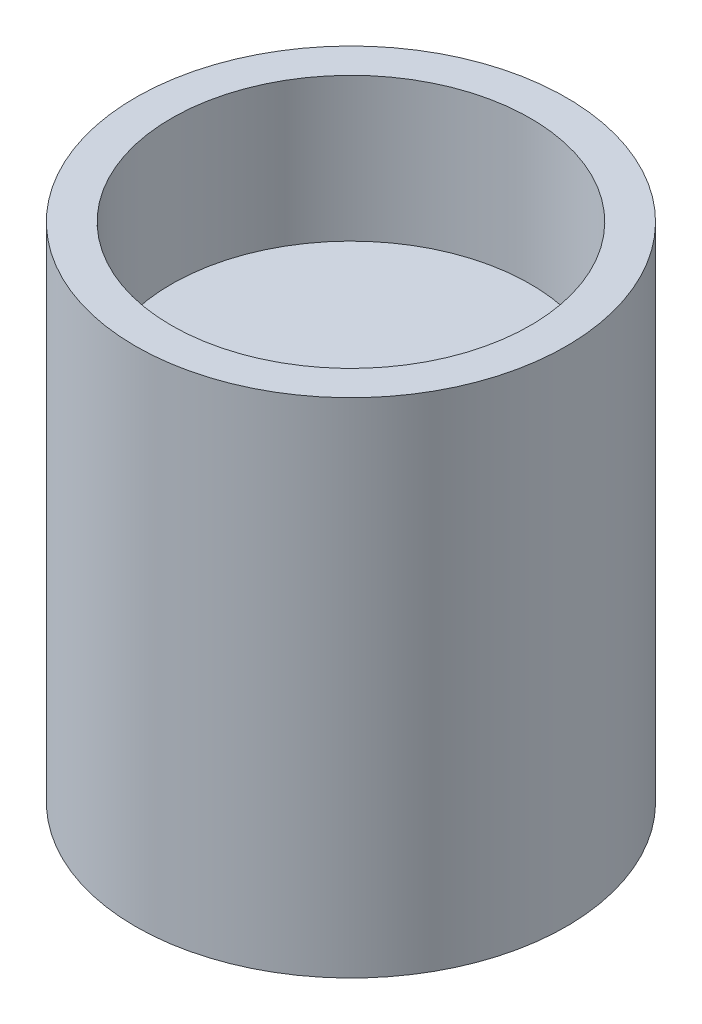
ISO-10303-21;
HEADER;
FILE_DESCRIPTION(('STEP AP214'),'2;1');
FILE_NAME('part.step','',(''),(''),'','','');
FILE_SCHEMA(('AUTOMOTIVE_DESIGN { 1 0 10303 214 1 1 1 1 }'));
ENDSEC;
DATA;
#1=APPLICATION_CONTEXT('core data for automotive mechanical design processes');
#2=APPLICATION_PROTOCOL_DEFINITION('international standard','automotive_design',2000,#1);
#3=PRODUCT_CONTEXT('',#1,'mechanical');
#4=PRODUCT('Part','Part','',(#3));
#5=PRODUCT_RELATED_PRODUCT_CATEGORY('part','',(#4));
#6=PRODUCT_DEFINITION_FORMATION('','',#4);
#7=PRODUCT_DEFINITION_CONTEXT('part definition',#1,'design');
#8=PRODUCT_DEFINITION('design','',#6,#7);
#9=PRODUCT_DEFINITION_SHAPE('','',#8);
#10=(LENGTH_UNIT() NAMED_UNIT(*) SI_UNIT(.MILLI.,.METRE.));
#11=(NAMED_UNIT(*) PLANE_ANGLE_UNIT() SI_UNIT($,.RADIAN.));
#12=(NAMED_UNIT(*) SI_UNIT($,.STERADIAN.) SOLID_ANGLE_UNIT());
#13=UNCERTAINTY_MEASURE_WITH_UNIT(LENGTH_MEASURE(1.E-05),#10,'distance_accuracy_value','');
#14=(GEOMETRIC_REPRESENTATION_CONTEXT(3) GLOBAL_UNCERTAINTY_ASSIGNED_CONTEXT((#13)) GLOBAL_UNIT_ASSIGNED_CONTEXT((#10,
#11,#12)) REPRESENTATION_CONTEXT('',''));
#15=CARTESIAN_POINT('',(0.,0.,0.));
#16=DIRECTION('',(0.,0.,1.));
#17=DIRECTION('',(1.,0.,0.));
#18=AXIS2_PLACEMENT_3D('',#15,#16,#17);
#19=CARTESIAN_POINT('',(0.,0.,0.));
#20=DIRECTION('',(0.,1.,0.));
#21=DIRECTION('',(0.,0.,1.));
#22=AXIS2_PLACEMENT_3D('',#19,#20,#21);
#23=PLANE('',#22);
#24=CARTESIAN_POINT('',(0.,0.,0.));
#25=DIRECTION('',(0.,1.,0.));
#26=DIRECTION('',(0.,0.,1.));
#27=AXIS2_PLACEMENT_3D('',#24,#25,#26);
#28=CIRCLE('',#27,3.);
#29=CARTESIAN_POINT('',(0.,0.,3.));
#30=VERTEX_POINT('',#29);
#31=EDGE_CURVE('E43',#30,#30,#28,.T.);
#32=ORIENTED_EDGE('',*,*,#31,.F.);
#33=EDGE_LOOP('',(#32));
#34=FACE_BOUND('',#33,.T.);
#35=CARTESIAN_POINT('',(0.,0.,0.));
#36=DIRECTION('',(0.,1.,0.));
#37=DIRECTION('',(0.,0.,1.));
#38=AXIS2_PLACEMENT_3D('',#35,#36,#37);
#39=CIRCLE('',#38,1.5);
#40=CARTESIAN_POINT('',(0.82915619758885,0.,-1.25));
#41=VERTEX_POINT('',#40);
#42=CARTESIAN_POINT('',(0.82915619758885,0.,1.25));
#43=VERTEX_POINT('',#42);
#44=EDGE_CURVE('E74',#41,#43,#39,.T.);
#45=ORIENTED_EDGE('',*,*,#44,.T.);
#46=DIRECTION('',(0.,0.,1.));
#47=VECTOR('',#46,1.);
#48=CARTESIAN_POINT('',(0.82915619758885,0.,0.));
#49=LINE('',#48,#47);
#50=EDGE_CURVE('E54',#41,#43,#49,.T.);
#51=ORIENTED_EDGE('',*,*,#50,.F.);
#52=EDGE_LOOP('',(#45,#51));
#53=FACE_BOUND('',#52,.T.);
#54=ADVANCED_FACE('F39',(#34,#53),#23,.F.);
#55=CARTESIAN_POINT('',(0.,7.,0.));
#56=DIRECTION('',(0.,-1.,0.));
#57=DIRECTION('',(0.,0.,-1.));
#58=AXIS2_PLACEMENT_3D('',#55,#56,#57);
#59=CYLINDRICAL_SURFACE('',#58,3.);
#60=CARTESIAN_POINT('',(0.,7.,0.));
#61=DIRECTION('',(0.,1.,0.));
#62=DIRECTION('',(0.,0.,1.));
#63=AXIS2_PLACEMENT_3D('',#60,#61,#62);
#64=CIRCLE('',#63,3.);
#65=CARTESIAN_POINT('',(0.,7.,3.));
#66=VERTEX_POINT('',#65);
#67=EDGE_CURVE('E11',#66,#66,#64,.T.);
#68=ORIENTED_EDGE('',*,*,#67,.F.);
#69=EDGE_LOOP('',(#68));
#70=FACE_BOUND('',#69,.T.);
#71=ORIENTED_EDGE('',*,*,#31,.T.);
#72=EDGE_LOOP('',(#71));
#73=FACE_BOUND('',#72,.T.);
#74=ADVANCED_FACE('F41',(#70,#73),#59,.T.);
#75=CARTESIAN_POINT('',(0.,7.,0.));
#76=DIRECTION('',(0.,1.,0.));
#77=DIRECTION('',(0.,0.,1.));
#78=AXIS2_PLACEMENT_3D('',#75,#76,#77);
#79=PLANE('',#78);
#80=CARTESIAN_POINT('',(0.,7.,0.));
#81=DIRECTION('',(0.,1.,0.));
#82=DIRECTION('',(0.,0.,1.));
#83=AXIS2_PLACEMENT_3D('',#80,#81,#82);
#84=CIRCLE('',#83,2.5);
#85=CARTESIAN_POINT('',(0.,7.,2.5));
#86=VERTEX_POINT('',#85);
#87=EDGE_CURVE('E81',#86,#86,#84,.T.);
#88=ORIENTED_EDGE('',*,*,#87,.F.);
#89=EDGE_LOOP('',(#88));
#90=FACE_BOUND('',#89,.T.);
#91=ORIENTED_EDGE('',*,*,#67,.T.);
#92=EDGE_LOOP('',(#91));
#93=FACE_BOUND('',#92,.T.);
#94=ADVANCED_FACE('F93',(#90,#93),#79,.T.);
#95=CARTESIAN_POINT('',(0.82915619758885,2.5,0.));
#96=DIRECTION('',(1.,0.,0.));
#97=DIRECTION('',(0.,0.,-1.));
#98=AXIS2_PLACEMENT_3D('',#95,#96,#97);
#99=PLANE('',#98);
#100=ORIENTED_EDGE('',*,*,#50,.T.);
#101=DIRECTION('',(0.,-1.,0.));
#102=VECTOR('',#101,1.);
#103=CARTESIAN_POINT('',(0.82915619758885,2.5,1.25));
#104=LINE('',#103,#102);
#105=CARTESIAN_POINT('',(0.82915619758885,2.5,1.25));
#106=VERTEX_POINT('',#105);
#107=EDGE_CURVE('E71',#106,#43,#104,.T.);
#108=ORIENTED_EDGE('',*,*,#107,.F.);
#109=DIRECTION('',(0.,0.,1.));
#110=VECTOR('',#109,1.);
#111=CARTESIAN_POINT('',(0.82915619758885,2.5,0.));
#112=LINE('',#111,#110);
#113=CARTESIAN_POINT('',(0.82915619758885,2.5,-1.25));
#114=VERTEX_POINT('',#113);
#115=EDGE_CURVE('E70',#114,#106,#112,.T.);
#116=ORIENTED_EDGE('',*,*,#115,.F.);
#117=DIRECTION('',(0.,-1.,0.));
#118=VECTOR('',#117,1.);
#119=CARTESIAN_POINT('',(0.82915619758885,2.5,-1.25));
#120=LINE('',#119,#118);
#121=EDGE_CURVE('E66',#114,#41,#120,.T.);
#122=ORIENTED_EDGE('',*,*,#121,.T.);
#123=EDGE_LOOP('',(#100,#108,#116,#122));
#124=FACE_BOUND('',#123,.T.);
#125=ADVANCED_FACE('F68',(#124),#99,.F.);
#126=CARTESIAN_POINT('',(0.,2.5,0.));
#127=DIRECTION('',(0.,-1.,0.));
#128=DIRECTION('',(0.,0.,-1.));
#129=AXIS2_PLACEMENT_3D('',#126,#127,#128);
#130=CYLINDRICAL_SURFACE('',#129,1.5);
#131=ORIENTED_EDGE('',*,*,#44,.F.);
#132=ORIENTED_EDGE('',*,*,#121,.F.);
#133=CARTESIAN_POINT('',(0.,2.5,0.));
#134=DIRECTION('',(0.,1.,0.));
#135=DIRECTION('',(0.,0.,1.));
#136=AXIS2_PLACEMENT_3D('',#133,#134,#135);
#137=CIRCLE('',#136,1.5);
#138=EDGE_CURVE('E62',#114,#106,#137,.T.);
#139=ORIENTED_EDGE('',*,*,#138,.T.);
#140=ORIENTED_EDGE('',*,*,#107,.T.);
#141=EDGE_LOOP('',(#131,#132,#139,#140));
#142=FACE_BOUND('',#141,.T.);
#143=ADVANCED_FACE('F75',(#142),#130,.F.);
#144=CARTESIAN_POINT('',(0.,2.5,0.));
#145=DIRECTION('',(0.,1.,0.));
#146=DIRECTION('',(0.,0.,1.));
#147=AXIS2_PLACEMENT_3D('',#144,#145,#146);
#148=PLANE('',#147);
#149=ORIENTED_EDGE('',*,*,#115,.T.);
#150=ORIENTED_EDGE('',*,*,#138,.F.);
#151=EDGE_LOOP('',(#149,#150));
#152=FACE_BOUND('',#151,.T.);
#153=ADVANCED_FACE('F112',(#152),#148,.F.);
#154=CARTESIAN_POINT('',(0.,5.,0.));
#155=DIRECTION('',(0.,1.,0.));
#156=DIRECTION('',(0.,0.,1.));
#157=AXIS2_PLACEMENT_3D('',#154,#155,#156);
#158=CYLINDRICAL_SURFACE('',#157,2.5);
#159=CARTESIAN_POINT('',(0.,5.,0.));
#160=DIRECTION('',(0.,1.,0.));
#161=DIRECTION('',(0.,0.,1.));
#162=AXIS2_PLACEMENT_3D('',#159,#160,#161);
#163=CIRCLE('',#162,2.5);
#164=CARTESIAN_POINT('',(0.,5.,2.5));
#165=VERTEX_POINT('',#164);
#166=EDGE_CURVE('E78',#165,#165,#163,.T.);
#167=ORIENTED_EDGE('',*,*,#166,.F.);
#168=EDGE_LOOP('',(#167));
#169=FACE_BOUND('',#168,.T.);
#170=ORIENTED_EDGE('',*,*,#87,.T.);
#171=EDGE_LOOP('',(#170));
#172=FACE_BOUND('',#171,.T.);
#173=ADVANCED_FACE('F91',(#169,#172),#158,.F.);
#174=CARTESIAN_POINT('',(0.,5.,0.));
#175=DIRECTION('',(0.,1.,0.));
#176=DIRECTION('',(0.,0.,1.));
#177=AXIS2_PLACEMENT_3D('',#174,#175,#176);
#178=PLANE('',#177);
#179=ORIENTED_EDGE('',*,*,#166,.T.);
#180=EDGE_LOOP('',(#179));
#181=FACE_BOUND('',#180,.T.);
#182=ADVANCED_FACE('F117',(#181),#178,.T.);
#183=CLOSED_SHELL('',(#54,#74,#94,#125,#143,#153,#173,#182));
#184=MANIFOLD_SOLID_BREP('B2',#183);
#185=ADVANCED_BREP_SHAPE_REPRESENTATION('',(#18,#184),#14);
#186=SHAPE_DEFINITION_REPRESENTATION(#9,#185);
ENDSEC;
END-ISO-10303-21;
